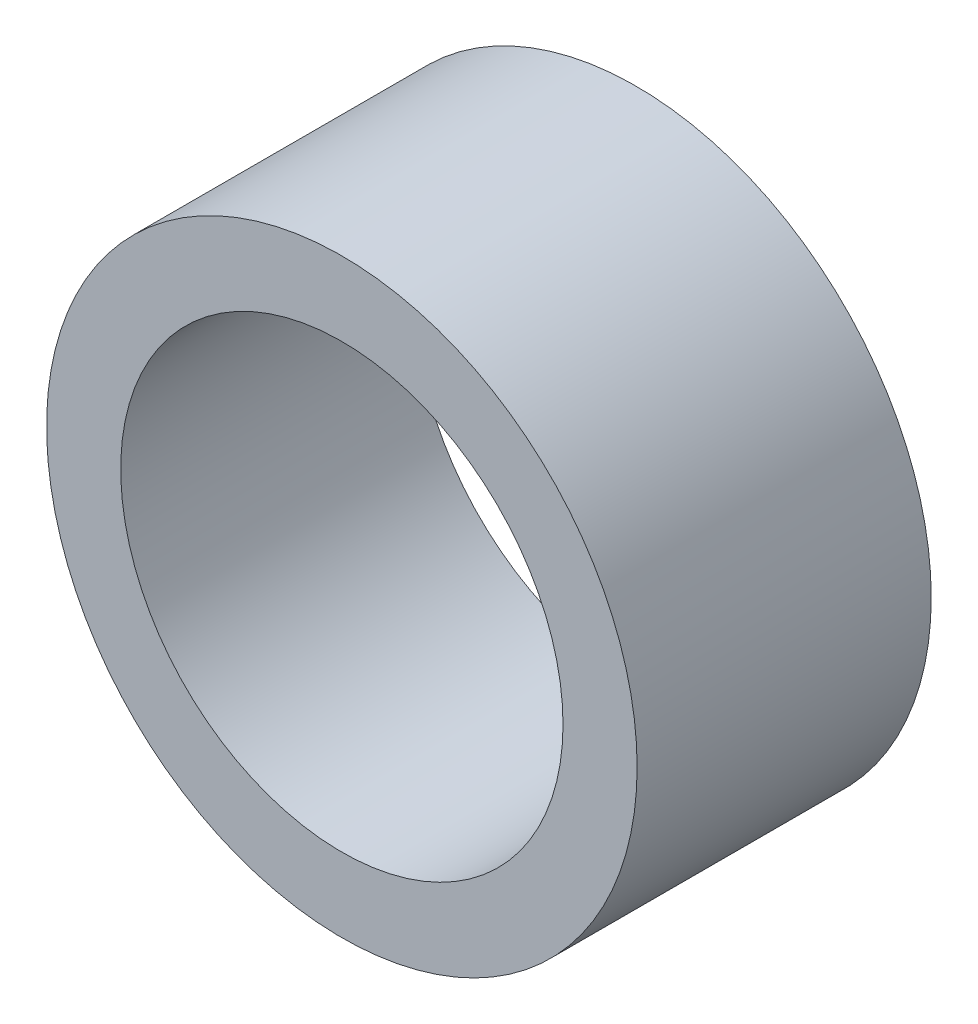
ISO-10303-21;
HEADER;
FILE_DESCRIPTION(('STEP AP214'),'2;1');
FILE_NAME('part.step','',(''),(''),'','','');
FILE_SCHEMA(('AUTOMOTIVE_DESIGN { 1 0 10303 214 1 1 1 1 }'));
ENDSEC;
DATA;
#1=APPLICATION_CONTEXT('core data for automotive mechanical design processes');
#2=APPLICATION_PROTOCOL_DEFINITION('international standard','automotive_design',2000,#1);
#3=PRODUCT_CONTEXT('',#1,'mechanical');
#4=PRODUCT('Part','Part','',(#3));
#5=PRODUCT_RELATED_PRODUCT_CATEGORY('part','',(#4));
#6=PRODUCT_DEFINITION_FORMATION('','',#4);
#7=PRODUCT_DEFINITION_CONTEXT('part definition',#1,'design');
#8=PRODUCT_DEFINITION('design','',#6,#7);
#9=PRODUCT_DEFINITION_SHAPE('','',#8);
#10=(LENGTH_UNIT() NAMED_UNIT(*) SI_UNIT(.MILLI.,.METRE.));
#11=(NAMED_UNIT(*) PLANE_ANGLE_UNIT() SI_UNIT($,.RADIAN.));
#12=(NAMED_UNIT(*) SI_UNIT($,.STERADIAN.) SOLID_ANGLE_UNIT());
#13=UNCERTAINTY_MEASURE_WITH_UNIT(LENGTH_MEASURE(1.E-05),#10,'distance_accuracy_value','');
#14=(GEOMETRIC_REPRESENTATION_CONTEXT(3) GLOBAL_UNCERTAINTY_ASSIGNED_CONTEXT((#13)) GLOBAL_UNIT_ASSIGNED_CONTEXT((#10,
#11,#12)) REPRESENTATION_CONTEXT('',''));
#15=CARTESIAN_POINT('',(0.,0.,0.));
#16=DIRECTION('',(0.,0.,1.));
#17=DIRECTION('',(1.,0.,0.));
#18=AXIS2_PLACEMENT_3D('',#15,#16,#17);
#19=CARTESIAN_POINT('',(0.,0.,3.175));
#20=DIRECTION('',(0.,0.,1.));
#21=DIRECTION('',(1.,0.,0.));
#22=AXIS2_PLACEMENT_3D('',#19,#20,#21);
#23=PLANE('',#22);
#24=CARTESIAN_POINT('',(0.,0.,3.175));
#25=DIRECTION('',(0.,0.,1.));
#26=DIRECTION('',(1.,0.,0.));
#27=AXIS2_PLACEMENT_3D('',#24,#25,#26);
#28=CIRCLE('',#27,6.3754);
#29=CARTESIAN_POINT('',(6.3754,0.,3.175));
#30=VERTEX_POINT('',#29);
#31=EDGE_CURVE('E10',#30,#30,#28,.T.);
#32=ORIENTED_EDGE('',*,*,#31,.T.);
#33=EDGE_LOOP('',(#32));
#34=FACE_BOUND('',#33,.T.);
#35=CARTESIAN_POINT('',(0.,0.,3.175));
#36=DIRECTION('',(0.,0.,1.));
#37=DIRECTION('',(1.,0.,0.));
#38=AXIS2_PLACEMENT_3D('',#35,#36,#37);
#39=CIRCLE('',#38,4.7752);
#40=CARTESIAN_POINT('',(4.7752,0.,3.175));
#41=VERTEX_POINT('',#40);
#42=EDGE_CURVE('E43',#41,#41,#39,.T.);
#43=ORIENTED_EDGE('',*,*,#42,.F.);
#44=EDGE_LOOP('',(#43));
#45=FACE_BOUND('',#44,.T.);
#46=ADVANCED_FACE('F32',(#34,#45),#23,.T.);
#47=CARTESIAN_POINT('',(0.,0.,-3.175));
#48=DIRECTION('',(0.,0.,1.));
#49=DIRECTION('',(1.,0.,0.));
#50=AXIS2_PLACEMENT_3D('',#47,#48,#49);
#51=PLANE('',#50);
#52=CARTESIAN_POINT('',(0.,0.,-3.175));
#53=DIRECTION('',(0.,0.,1.));
#54=DIRECTION('',(1.,0.,0.));
#55=AXIS2_PLACEMENT_3D('',#52,#53,#54);
#56=CIRCLE('',#55,6.3754);
#57=CARTESIAN_POINT('',(6.3754,0.,-3.175));
#58=VERTEX_POINT('',#57);
#59=EDGE_CURVE('E36',#58,#58,#56,.T.);
#60=ORIENTED_EDGE('',*,*,#59,.F.);
#61=EDGE_LOOP('',(#60));
#62=FACE_BOUND('',#61,.T.);
#63=CARTESIAN_POINT('',(0.,0.,-3.175));
#64=DIRECTION('',(0.,0.,1.));
#65=DIRECTION('',(1.,0.,0.));
#66=AXIS2_PLACEMENT_3D('',#63,#64,#65);
#67=CIRCLE('',#66,4.7752);
#68=CARTESIAN_POINT('',(4.7752,0.,-3.175));
#69=VERTEX_POINT('',#68);
#70=EDGE_CURVE('E45',#69,#69,#67,.T.);
#71=ORIENTED_EDGE('',*,*,#70,.T.);
#72=EDGE_LOOP('',(#71));
#73=FACE_BOUND('',#72,.T.);
#74=ADVANCED_FACE('F55',(#62,#73),#51,.F.);
#75=CARTESIAN_POINT('',(0.,0.,3.175));
#76=DIRECTION('',(0.,0.,-1.));
#77=DIRECTION('',(-1.,0.,0.));
#78=AXIS2_PLACEMENT_3D('',#75,#76,#77);
#79=CYLINDRICAL_SURFACE('',#78,6.3754);
#80=ORIENTED_EDGE('',*,*,#31,.F.);
#81=EDGE_LOOP('',(#80));
#82=FACE_BOUND('',#81,.T.);
#83=ORIENTED_EDGE('',*,*,#59,.T.);
#84=EDGE_LOOP('',(#83));
#85=FACE_BOUND('',#84,.T.);
#86=ADVANCED_FACE('F34',(#82,#85),#79,.T.);
#87=CARTESIAN_POINT('',(0.,0.,3.175));
#88=DIRECTION('',(0.,0.,-1.));
#89=DIRECTION('',(-1.,0.,0.));
#90=AXIS2_PLACEMENT_3D('',#87,#88,#89);
#91=CYLINDRICAL_SURFACE('',#90,4.7752);
#92=ORIENTED_EDGE('',*,*,#42,.T.);
#93=EDGE_LOOP('',(#92));
#94=FACE_BOUND('',#93,.T.);
#95=ORIENTED_EDGE('',*,*,#70,.F.);
#96=EDGE_LOOP('',(#95));
#97=FACE_BOUND('',#96,.T.);
#98=ADVANCED_FACE('F51',(#94,#97),#91,.F.);
#99=CLOSED_SHELL('',(#46,#74,#86,#98));
#100=MANIFOLD_SOLID_BREP('B2',#99);
#101=ADVANCED_BREP_SHAPE_REPRESENTATION('',(#18,#100),#14);
#102=SHAPE_DEFINITION_REPRESENTATION(#9,#101);
ENDSEC;
END-ISO-10303-21;
